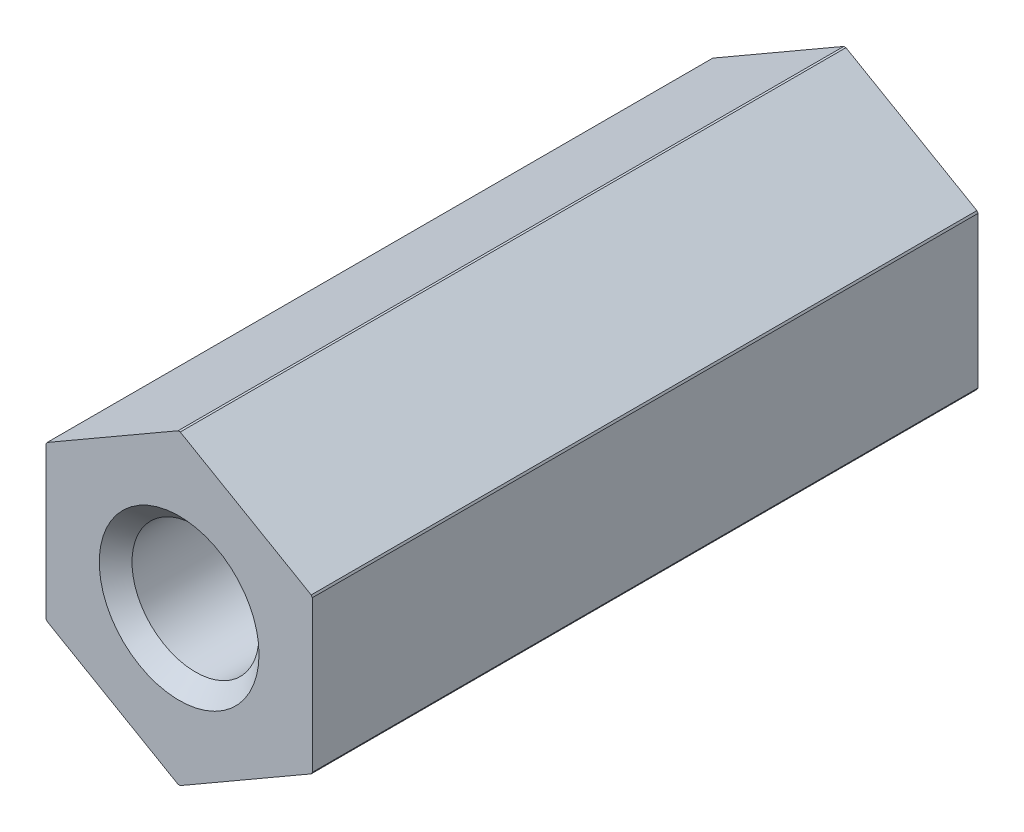
ISO-10303-21;
HEADER;
FILE_DESCRIPTION(('STEP AP214'),'2;1');
FILE_NAME('part.step','',(''),(''),'','','');
FILE_SCHEMA(('AUTOMOTIVE_DESIGN { 1 0 10303 214 1 1 1 1 }'));
ENDSEC;
DATA;
#1=APPLICATION_CONTEXT('core data for automotive mechanical design processes');
#2=APPLICATION_PROTOCOL_DEFINITION('international standard','automotive_design',2000,#1);
#3=PRODUCT_CONTEXT('',#1,'mechanical');
#4=PRODUCT('Part','Part','',(#3));
#5=PRODUCT_RELATED_PRODUCT_CATEGORY('part','',(#4));
#6=PRODUCT_DEFINITION_FORMATION('','',#4);
#7=PRODUCT_DEFINITION_CONTEXT('part definition',#1,'design');
#8=PRODUCT_DEFINITION('design','',#6,#7);
#9=PRODUCT_DEFINITION_SHAPE('','',#8);
#10=(LENGTH_UNIT() NAMED_UNIT(*) SI_UNIT(.MILLI.,.METRE.));
#11=(NAMED_UNIT(*) PLANE_ANGLE_UNIT() SI_UNIT($,.RADIAN.));
#12=(NAMED_UNIT(*) SI_UNIT($,.STERADIAN.) SOLID_ANGLE_UNIT());
#13=UNCERTAINTY_MEASURE_WITH_UNIT(LENGTH_MEASURE(1.E-05),#10,'distance_accuracy_value','');
#14=(GEOMETRIC_REPRESENTATION_CONTEXT(3) GLOBAL_UNCERTAINTY_ASSIGNED_CONTEXT((#13)) GLOBAL_UNIT_ASSIGNED_CONTEXT((#10,
#11,#12)) REPRESENTATION_CONTEXT('',''));
#15=CARTESIAN_POINT('',(0.,0.,0.));
#16=DIRECTION('',(0.,0.,1.));
#17=DIRECTION('',(1.,0.,0.));
#18=AXIS2_PLACEMENT_3D('',#15,#16,#17);
#19=CARTESIAN_POINT('',(0.,0.,0.));
#20=DIRECTION('',(0.,0.,1.));
#21=DIRECTION('',(1.,0.,0.));
#22=AXIS2_PLACEMENT_3D('',#19,#20,#21);
#23=CYLINDRICAL_SURFACE('',#22,5.75);
#24=CARTESIAN_POINT('',(0.,0.,0.));
#25=DIRECTION('',(0.,0.,1.));
#26=DIRECTION('',(1.,0.,0.));
#27=AXIS2_PLACEMENT_3D('',#24,#25,#26);
#28=CIRCLE('',#27,5.75);
#29=CARTESIAN_POINT('',(0.0409605533868234,5.74985410537226,0.));
#30=VERTEX_POINT('',#29);
#31=CARTESIAN_POINT('',(-0.0409605533868229,5.74985410537226,0.));
#32=VERTEX_POINT('',#31);
#33=EDGE_CURVE('E142',#30,#32,#28,.T.);
#34=ORIENTED_EDGE('',*,*,#33,.T.);
#35=DIRECTION('',(0.,0.,1.));
#36=VECTOR('',#35,1.);
#37=CARTESIAN_POINT('',(-0.0409605533868234,5.74985410537226,0.));
#38=LINE('',#37,#36);
#39=CARTESIAN_POINT('',(-0.0409605533868229,5.74985410537226,25.));
#40=VERTEX_POINT('',#39);
#41=EDGE_CURVE('E11',#32,#40,#38,.T.);
#42=ORIENTED_EDGE('',*,*,#41,.T.);
#43=CARTESIAN_POINT('',(0.,0.,25.));
#44=DIRECTION('',(0.,0.,1.));
#45=DIRECTION('',(1.,0.,0.));
#46=AXIS2_PLACEMENT_3D('',#43,#44,#45);
#47=CIRCLE('',#46,5.75);
#48=CARTESIAN_POINT('',(0.0409605533868212,5.74985410537226,25.));
#49=VERTEX_POINT('',#48);
#50=EDGE_CURVE('E164',#49,#40,#47,.T.);
#51=ORIENTED_EDGE('',*,*,#50,.F.);
#52=DIRECTION('',(0.,0.,1.));
#53=VECTOR('',#52,1.);
#54=CARTESIAN_POINT('',(0.0409605533868234,5.74985410537226,0.));
#55=LINE('',#54,#53);
#56=EDGE_CURVE('E130',#49,#30,#55,.F.);
#57=ORIENTED_EDGE('',*,*,#56,.T.);
#58=EDGE_LOOP('',(#34,#42,#51,#57));
#59=FACE_BOUND('',#58,.T.);
#60=ADVANCED_FACE('F30',(#59),#23,.T.);
#61=CARTESIAN_POINT('',(-4.95903944661327,2.91039993247208,25.));
#62=VERTEX_POINT('',#61);
#63=CARTESIAN_POINT('',(-5.,2.83945417290014,25.));
#64=VERTEX_POINT('',#63);
#65=EDGE_CURVE('E169',#62,#64,#47,.T.);
#66=ORIENTED_EDGE('',*,*,#65,.F.);
#67=DIRECTION('',(0.,0.,1.));
#68=VECTOR('',#67,1.);
#69=CARTESIAN_POINT('',(-4.95903944661327,2.91039993247208,0.));
#70=LINE('',#69,#68);
#71=CARTESIAN_POINT('',(-4.95903944661327,2.91039993247208,0.));
#72=VERTEX_POINT('',#71);
#73=EDGE_CURVE('E38',#62,#72,#70,.F.);
#74=ORIENTED_EDGE('',*,*,#73,.T.);
#75=CARTESIAN_POINT('',(-5.,2.83945417290014,0.));
#76=VERTEX_POINT('',#75);
#77=EDGE_CURVE('E154',#72,#76,#28,.T.);
#78=ORIENTED_EDGE('',*,*,#77,.T.);
#79=DIRECTION('',(0.,0.,1.));
#80=VECTOR('',#79,1.);
#81=CARTESIAN_POINT('',(-5.,2.83945417290014,0.));
#82=LINE('',#81,#80);
#83=EDGE_CURVE('E211',#76,#64,#82,.T.);
#84=ORIENTED_EDGE('',*,*,#83,.T.);
#85=EDGE_LOOP('',(#66,#74,#78,#84));
#86=FACE_BOUND('',#85,.T.);
#87=ADVANCED_FACE('F217',(#86),#23,.T.);
#88=CARTESIAN_POINT('',(-5.,-2.83945417290014,25.));
#89=VERTEX_POINT('',#88);
#90=CARTESIAN_POINT('',(-4.95903944661327,-2.91039993247208,25.));
#91=VERTEX_POINT('',#90);
#92=EDGE_CURVE('E175',#89,#91,#47,.T.);
#93=ORIENTED_EDGE('',*,*,#92,.F.);
#94=DIRECTION('',(0.,0.,1.));
#95=VECTOR('',#94,1.);
#96=CARTESIAN_POINT('',(-5.,-2.83945417290014,0.));
#97=LINE('',#96,#95);
#98=CARTESIAN_POINT('',(-5.,-2.83945417290014,0.));
#99=VERTEX_POINT('',#98);
#100=EDGE_CURVE('E203',#89,#99,#97,.F.);
#101=ORIENTED_EDGE('',*,*,#100,.T.);
#102=CARTESIAN_POINT('',(-4.95903944661327,-2.91039993247208,0.));
#103=VERTEX_POINT('',#102);
#104=EDGE_CURVE('E163',#99,#103,#28,.T.);
#105=ORIENTED_EDGE('',*,*,#104,.T.);
#106=DIRECTION('',(0.,0.,1.));
#107=VECTOR('',#106,1.);
#108=CARTESIAN_POINT('',(-4.95903944661327,-2.91039993247208,0.));
#109=LINE('',#108,#107);
#110=EDGE_CURVE('E200',#103,#91,#109,.T.);
#111=ORIENTED_EDGE('',*,*,#110,.T.);
#112=EDGE_LOOP('',(#93,#101,#105,#111));
#113=FACE_BOUND('',#112,.T.);
#114=ADVANCED_FACE('F226',(#113),#23,.T.);
#115=CARTESIAN_POINT('',(-0.0409605533868212,-5.74985410537226,25.));
#116=VERTEX_POINT('',#115);
#117=CARTESIAN_POINT('',(0.0409605533868229,-5.74985410537226,25.));
#118=VERTEX_POINT('',#117);
#119=EDGE_CURVE('E171',#116,#118,#47,.T.);
#120=ORIENTED_EDGE('',*,*,#119,.F.);
#121=DIRECTION('',(0.,0.,1.));
#122=VECTOR('',#121,1.);
#123=CARTESIAN_POINT('',(-0.0409605533868234,-5.74985410537226,0.));
#124=LINE('',#123,#122);
#125=CARTESIAN_POINT('',(-0.0409605533868234,-5.74985410537226,0.));
#126=VERTEX_POINT('',#125);
#127=EDGE_CURVE('E198',#116,#126,#124,.F.);
#128=ORIENTED_EDGE('',*,*,#127,.T.);
#129=CARTESIAN_POINT('',(0.0409605533868229,-5.74985410537226,0.));
#130=VERTEX_POINT('',#129);
#131=EDGE_CURVE('E157',#126,#130,#28,.T.);
#132=ORIENTED_EDGE('',*,*,#131,.T.);
#133=DIRECTION('',(0.,0.,1.));
#134=VECTOR('',#133,1.);
#135=CARTESIAN_POINT('',(0.0409605533868234,-5.74985410537226,0.));
#136=LINE('',#135,#134);
#137=EDGE_CURVE('E197',#130,#118,#136,.T.);
#138=ORIENTED_EDGE('',*,*,#137,.T.);
#139=EDGE_LOOP('',(#120,#128,#132,#138));
#140=FACE_BOUND('',#139,.T.);
#141=ADVANCED_FACE('F196',(#140),#23,.T.);
#142=CARTESIAN_POINT('',(4.95903944661327,-2.91039993247208,25.));
#143=VERTEX_POINT('',#142);
#144=CARTESIAN_POINT('',(5.,-2.83945417290014,25.));
#145=VERTEX_POINT('',#144);
#146=EDGE_CURVE('E165',#143,#145,#47,.T.);
#147=ORIENTED_EDGE('',*,*,#146,.F.);
#148=DIRECTION('',(0.,0.,1.));
#149=VECTOR('',#148,1.);
#150=CARTESIAN_POINT('',(4.95903944661327,-2.91039993247208,0.));
#151=LINE('',#150,#149);
#152=CARTESIAN_POINT('',(4.95903944661327,-2.91039993247208,0.));
#153=VERTEX_POINT('',#152);
#154=EDGE_CURVE('E205',#143,#153,#151,.F.);
#155=ORIENTED_EDGE('',*,*,#154,.T.);
#156=CARTESIAN_POINT('',(5.,-2.83945417290014,0.));
#157=VERTEX_POINT('',#156);
#158=EDGE_CURVE('E150',#153,#157,#28,.T.);
#159=ORIENTED_EDGE('',*,*,#158,.T.);
#160=DIRECTION('',(0.,0.,1.));
#161=VECTOR('',#160,1.);
#162=CARTESIAN_POINT('',(5.,-2.83945417290014,0.));
#163=LINE('',#162,#161);
#164=EDGE_CURVE('E191',#157,#145,#163,.T.);
#165=ORIENTED_EDGE('',*,*,#164,.T.);
#166=EDGE_LOOP('',(#147,#155,#159,#165));
#167=FACE_BOUND('',#166,.T.);
#168=ADVANCED_FACE('F236',(#167),#23,.T.);
#169=CARTESIAN_POINT('',(0.,5.75,25.));
#170=DIRECTION('',(0.,0.,-1.));
#171=DIRECTION('',(-1.,0.,0.));
#172=AXIS2_PLACEMENT_3D('',#169,#170,#171);
#173=PLANE('',#172);
#174=CARTESIAN_POINT('',(0.,0.,25.));
#175=DIRECTION('',(0.,0.,1.));
#176=DIRECTION('',(1.,0.,0.));
#177=AXIS2_PLACEMENT_3D('',#174,#175,#176);
#178=CIRCLE('',#177,3.);
#179=CARTESIAN_POINT('',(3.,0.,25.));
#180=VERTEX_POINT('',#179);
#181=EDGE_CURVE('E241',#180,#180,#178,.T.);
#182=ORIENTED_EDGE('',*,*,#181,.F.);
#183=EDGE_LOOP('',(#182));
#184=FACE_BOUND('',#183,.T.);
#185=ORIENTED_EDGE('',*,*,#50,.T.);
#186=DIRECTION('',(-0.866025403784433,-0.500000000000009,0.));
#187=VECTOR('',#186,1.);
#188=CARTESIAN_POINT('',(0.,5.7735026918963,25.));
#189=LINE('',#188,#187);
#190=EDGE_CURVE('E143',#40,#62,#189,.T.);
#191=ORIENTED_EDGE('',*,*,#190,.T.);
#192=ORIENTED_EDGE('',*,*,#65,.T.);
#193=DIRECTION('',(0.,-1.,0.));
#194=VECTOR('',#193,1.);
#195=CARTESIAN_POINT('',(-5.,2.8867513459481,25.));
#196=LINE('',#195,#194);
#197=EDGE_CURVE('E231',#64,#89,#196,.T.);
#198=ORIENTED_EDGE('',*,*,#197,.T.);
#199=ORIENTED_EDGE('',*,*,#92,.T.);
#200=DIRECTION('',(0.866025403784433,-0.500000000000009,0.));
#201=VECTOR('',#200,1.);
#202=CARTESIAN_POINT('',(-5.,-2.8867513459481,25.));
#203=LINE('',#202,#201);
#204=EDGE_CURVE('E232',#91,#116,#203,.T.);
#205=ORIENTED_EDGE('',*,*,#204,.T.);
#206=ORIENTED_EDGE('',*,*,#119,.T.);
#207=DIRECTION('',(0.866025403784433,0.500000000000009,0.));
#208=VECTOR('',#207,1.);
#209=CARTESIAN_POINT('',(0.,-5.7735026918963,25.));
#210=LINE('',#209,#208);
#211=EDGE_CURVE('E179',#118,#143,#210,.T.);
#212=ORIENTED_EDGE('',*,*,#211,.T.);
#213=ORIENTED_EDGE('',*,*,#146,.T.);
#214=DIRECTION('',(0.,1.,0.));
#215=VECTOR('',#214,1.);
#216=CARTESIAN_POINT('',(5.,-2.8867513459481,25.));
#217=LINE('',#216,#215);
#218=CARTESIAN_POINT('',(5.,2.83945417290014,25.));
#219=VERTEX_POINT('',#218);
#220=EDGE_CURVE('E176',#145,#219,#217,.T.);
#221=ORIENTED_EDGE('',*,*,#220,.T.);
#222=CARTESIAN_POINT('',(4.95903944661327,2.91039993247208,25.));
#223=VERTEX_POINT('',#222);
#224=EDGE_CURVE('E158',#219,#223,#47,.T.);
#225=ORIENTED_EDGE('',*,*,#224,.T.);
#226=DIRECTION('',(-0.866025403784433,0.500000000000009,0.));
#227=VECTOR('',#226,1.);
#228=CARTESIAN_POINT('',(5.,2.8867513459481,25.));
#229=LINE('',#228,#227);
#230=EDGE_CURVE('E124',#223,#49,#229,.T.);
#231=ORIENTED_EDGE('',*,*,#230,.T.);
#232=EDGE_LOOP('',(#185,#191,#192,#198,#199,#205,#206,#212,#213,#221,#225,#231));
#233=FACE_BOUND('',#232,.T.);
#234=ADVANCED_FACE('F32',(#184,#233),#173,.F.);
#235=CARTESIAN_POINT('',(0.,0.,25.));
#236=DIRECTION('',(0.,0.,1.));
#237=DIRECTION('',(1.,0.,0.));
#238=AXIS2_PLACEMENT_3D('',#235,#236,#237);
#239=CONICAL_SURFACE('',#238,3.,0.785398163397448);
#240=CARTESIAN_POINT('',(0.,0.,24.385665));
#241=DIRECTION('',(0.,0.,1.));
#242=DIRECTION('',(1.,0.,0.));
#243=AXIS2_PLACEMENT_3D('',#240,#241,#242);
#244=CIRCLE('',#243,2.385665);
#245=CARTESIAN_POINT('',(2.385665,0.,24.385665));
#246=VERTEX_POINT('',#245);
#247=EDGE_CURVE('E244',#246,#246,#244,.T.);
#248=ORIENTED_EDGE('',*,*,#247,.F.);
#249=EDGE_LOOP('',(#248));
#250=FACE_BOUND('',#249,.T.);
#251=ORIENTED_EDGE('',*,*,#181,.T.);
#252=EDGE_LOOP('',(#251));
#253=FACE_BOUND('',#252,.T.);
#254=ADVANCED_FACE('F255',(#250,#253),#239,.F.);
#255=CARTESIAN_POINT('',(0.,0.,0.));
#256=DIRECTION('',(0.,0.,1.));
#257=DIRECTION('',(1.,0.,0.));
#258=AXIS2_PLACEMENT_3D('',#255,#256,#257);
#259=CYLINDRICAL_SURFACE('',#258,2.385665);
#260=CARTESIAN_POINT('',(0.,0.,1.3174456590112));
#261=DIRECTION('',(0.,0.,1.));
#262=DIRECTION('',(1.,0.,0.));
#263=AXIS2_PLACEMENT_3D('',#260,#261,#262);
#264=CIRCLE('',#263,2.385665);
#265=CARTESIAN_POINT('',(2.385665,0.,1.3174456590112));
#266=VERTEX_POINT('',#265);
#267=EDGE_CURVE('E152',#266,#266,#264,.T.);
#268=ORIENTED_EDGE('',*,*,#267,.F.);
#269=EDGE_LOOP('',(#268));
#270=FACE_BOUND('',#269,.T.);
#271=ORIENTED_EDGE('',*,*,#247,.T.);
#272=EDGE_LOOP('',(#271));
#273=FACE_BOUND('',#272,.T.);
#274=ADVANCED_FACE('F252',(#270,#273),#259,.F.);
#275=CARTESIAN_POINT('',(0.,0.,1.3174456590112));
#276=DIRECTION('',(0.,0.,-1.));
#277=DIRECTION('',(-1.,0.,0.));
#278=AXIS2_PLACEMENT_3D('',#275,#276,#277);
#279=CONICAL_SURFACE('',#278,2.385665,0.436332312998594);
#280=CARTESIAN_POINT('',(0.,0.,0.));
#281=DIRECTION('',(0.,0.,1.));
#282=DIRECTION('',(1.,0.,0.));
#283=AXIS2_PLACEMENT_3D('',#280,#281,#282);
#284=CIRCLE('',#283,3.);
#285=CARTESIAN_POINT('',(3.,0.,0.));
#286=VERTEX_POINT('',#285);
#287=EDGE_CURVE('E148',#286,#286,#284,.T.);
#288=ORIENTED_EDGE('',*,*,#287,.F.);
#289=EDGE_LOOP('',(#288));
#290=FACE_BOUND('',#289,.T.);
#291=ORIENTED_EDGE('',*,*,#267,.T.);
#292=EDGE_LOOP('',(#291));
#293=FACE_BOUND('',#292,.T.);
#294=ADVANCED_FACE('F250',(#290,#293),#279,.F.);
#295=CARTESIAN_POINT('',(0.,3.,0.));
#296=DIRECTION('',(0.,0.,1.));
#297=DIRECTION('',(1.,0.,0.));
#298=AXIS2_PLACEMENT_3D('',#295,#296,#297);
#299=PLANE('',#298);
#300=ORIENTED_EDGE('',*,*,#77,.F.);
#301=DIRECTION('',(-0.866025403784433,-0.500000000000009,0.));
#302=VECTOR('',#301,1.);
#303=CARTESIAN_POINT('',(0.,5.7735026918963,0.));
#304=LINE('',#303,#302);
#305=EDGE_CURVE('E183',#32,#72,#304,.T.);
#306=ORIENTED_EDGE('',*,*,#305,.F.);
#307=ORIENTED_EDGE('',*,*,#33,.F.);
#308=DIRECTION('',(-0.866025403784433,0.500000000000009,0.));
#309=VECTOR('',#308,1.);
#310=CARTESIAN_POINT('',(5.,2.8867513459481,0.));
#311=LINE('',#310,#309);
#312=CARTESIAN_POINT('',(4.95903944661327,2.91039993247208,0.));
#313=VERTEX_POINT('',#312);
#314=EDGE_CURVE('E121',#313,#30,#311,.T.);
#315=ORIENTED_EDGE('',*,*,#314,.F.);
#316=CARTESIAN_POINT('',(5.,2.83945417290014,0.));
#317=VERTEX_POINT('',#316);
#318=EDGE_CURVE('E139',#317,#313,#28,.T.);
#319=ORIENTED_EDGE('',*,*,#318,.F.);
#320=DIRECTION('',(0.,1.,0.));
#321=VECTOR('',#320,1.);
#322=CARTESIAN_POINT('',(5.,-2.8867513459481,0.));
#323=LINE('',#322,#321);
#324=EDGE_CURVE('E144',#157,#317,#323,.T.);
#325=ORIENTED_EDGE('',*,*,#324,.F.);
#326=ORIENTED_EDGE('',*,*,#158,.F.);
#327=DIRECTION('',(0.866025403784433,0.500000000000009,0.));
#328=VECTOR('',#327,1.);
#329=CARTESIAN_POINT('',(0.,-5.7735026918963,0.));
#330=LINE('',#329,#328);
#331=EDGE_CURVE('E45',#130,#153,#330,.T.);
#332=ORIENTED_EDGE('',*,*,#331,.F.);
#333=ORIENTED_EDGE('',*,*,#131,.F.);
#334=DIRECTION('',(0.866025403784433,-0.500000000000009,0.));
#335=VECTOR('',#334,1.);
#336=CARTESIAN_POINT('',(-5.,-2.8867513459481,0.));
#337=LINE('',#336,#335);
#338=EDGE_CURVE('E53',#103,#126,#337,.T.);
#339=ORIENTED_EDGE('',*,*,#338,.F.);
#340=ORIENTED_EDGE('',*,*,#104,.F.);
#341=DIRECTION('',(0.,-1.,0.));
#342=VECTOR('',#341,1.);
#343=CARTESIAN_POINT('',(-5.,2.8867513459481,0.));
#344=LINE('',#343,#342);
#345=EDGE_CURVE('E185',#76,#99,#344,.T.);
#346=ORIENTED_EDGE('',*,*,#345,.F.);
#347=EDGE_LOOP('',(#300,#306,#307,#315,#319,#325,#326,#332,#333,#339,#340,#346));
#348=FACE_BOUND('',#347,.T.);
#349=ORIENTED_EDGE('',*,*,#287,.T.);
#350=EDGE_LOOP('',(#349));
#351=FACE_BOUND('',#350,.T.);
#352=ADVANCED_FACE('F136',(#348,#351),#299,.F.);
#353=ORIENTED_EDGE('',*,*,#224,.F.);
#354=DIRECTION('',(0.,0.,1.));
#355=VECTOR('',#354,1.);
#356=CARTESIAN_POINT('',(5.,2.83945417290014,0.));
#357=LINE('',#356,#355);
#358=EDGE_CURVE('E129',#219,#317,#357,.F.);
#359=ORIENTED_EDGE('',*,*,#358,.T.);
#360=ORIENTED_EDGE('',*,*,#318,.T.);
#361=DIRECTION('',(0.,0.,1.));
#362=VECTOR('',#361,1.);
#363=CARTESIAN_POINT('',(4.95903944661327,2.91039993247208,0.));
#364=LINE('',#363,#362);
#365=EDGE_CURVE('E118',#313,#223,#364,.T.);
#366=ORIENTED_EDGE('',*,*,#365,.T.);
#367=EDGE_LOOP('',(#353,#359,#360,#366));
#368=FACE_BOUND('',#367,.T.);
#369=ADVANCED_FACE('F147',(#368),#23,.T.);
#370=CARTESIAN_POINT('',(5.,2.8867513459481,25.));
#371=DIRECTION('',(-0.500000000000009,-0.866025403784433,0.));
#372=DIRECTION('',(0.866025403784433,-0.500000000000009,0.));
#373=AXIS2_PLACEMENT_3D('',#370,#371,#372);
#374=PLANE('',#373);
#375=ORIENTED_EDGE('',*,*,#314,.T.);
#376=ORIENTED_EDGE('',*,*,#56,.F.);
#377=ORIENTED_EDGE('',*,*,#230,.F.);
#378=ORIENTED_EDGE('',*,*,#365,.F.);
#379=EDGE_LOOP('',(#375,#376,#377,#378));
#380=FACE_BOUND('',#379,.T.);
#381=ADVANCED_FACE('F120',(#380),#374,.F.);
#382=CARTESIAN_POINT('',(5.,-2.8867513459481,25.));
#383=DIRECTION('',(-1.,0.,0.));
#384=DIRECTION('',(0.,0.,1.));
#385=AXIS2_PLACEMENT_3D('',#382,#383,#384);
#386=PLANE('',#385);
#387=ORIENTED_EDGE('',*,*,#324,.T.);
#388=ORIENTED_EDGE('',*,*,#358,.F.);
#389=ORIENTED_EDGE('',*,*,#220,.F.);
#390=ORIENTED_EDGE('',*,*,#164,.F.);
#391=EDGE_LOOP('',(#387,#388,#389,#390));
#392=FACE_BOUND('',#391,.T.);
#393=ADVANCED_FACE('F190',(#392),#386,.F.);
#394=CARTESIAN_POINT('',(0.,-5.7735026918963,25.));
#395=DIRECTION('',(-0.500000000000009,0.866025403784433,0.));
#396=DIRECTION('',(-0.866025403784433,-0.500000000000009,0.));
#397=AXIS2_PLACEMENT_3D('',#394,#395,#396);
#398=PLANE('',#397);
#399=ORIENTED_EDGE('',*,*,#331,.T.);
#400=ORIENTED_EDGE('',*,*,#154,.F.);
#401=ORIENTED_EDGE('',*,*,#211,.F.);
#402=ORIENTED_EDGE('',*,*,#137,.F.);
#403=EDGE_LOOP('',(#399,#400,#401,#402));
#404=FACE_BOUND('',#403,.T.);
#405=ADVANCED_FACE('F353',(#404),#398,.F.);
#406=CARTESIAN_POINT('',(-5.,-2.8867513459481,25.));
#407=DIRECTION('',(0.500000000000009,0.866025403784433,0.));
#408=DIRECTION('',(-0.866025403784433,0.500000000000009,0.));
#409=AXIS2_PLACEMENT_3D('',#406,#407,#408);
#410=PLANE('',#409);
#411=ORIENTED_EDGE('',*,*,#338,.T.);
#412=ORIENTED_EDGE('',*,*,#127,.F.);
#413=ORIENTED_EDGE('',*,*,#204,.F.);
#414=ORIENTED_EDGE('',*,*,#110,.F.);
#415=EDGE_LOOP('',(#411,#412,#413,#414));
#416=FACE_BOUND('',#415,.T.);
#417=ADVANCED_FACE('F361',(#416),#410,.F.);
#418=CARTESIAN_POINT('',(-5.,2.8867513459481,25.));
#419=DIRECTION('',(1.,0.,0.));
#420=DIRECTION('',(0.,0.,-1.));
#421=AXIS2_PLACEMENT_3D('',#418,#419,#420);
#422=PLANE('',#421);
#423=ORIENTED_EDGE('',*,*,#345,.T.);
#424=ORIENTED_EDGE('',*,*,#100,.F.);
#425=ORIENTED_EDGE('',*,*,#197,.F.);
#426=ORIENTED_EDGE('',*,*,#83,.F.);
#427=EDGE_LOOP('',(#423,#424,#425,#426));
#428=FACE_BOUND('',#427,.T.);
#429=ADVANCED_FACE('F230',(#428),#422,.F.);
#430=CARTESIAN_POINT('',(0.,5.7735026918963,25.));
#431=DIRECTION('',(0.500000000000009,-0.866025403784433,0.));
#432=DIRECTION('',(0.866025403784433,0.500000000000009,0.));
#433=AXIS2_PLACEMENT_3D('',#430,#431,#432);
#434=PLANE('',#433);
#435=ORIENTED_EDGE('',*,*,#305,.T.);
#436=ORIENTED_EDGE('',*,*,#73,.F.);
#437=ORIENTED_EDGE('',*,*,#190,.F.);
#438=ORIENTED_EDGE('',*,*,#41,.F.);
#439=EDGE_LOOP('',(#435,#436,#437,#438));
#440=FACE_BOUND('',#439,.T.);
#441=ADVANCED_FACE('F376',(#440),#434,.F.);
#442=CLOSED_SHELL('',(#60,#87,#114,#141,#168,#234,#254,#274,#294,#352,#369,#381,#393,#405,#417,
#429,#441));
#443=MANIFOLD_SOLID_BREP('B2',#442);
#444=ADVANCED_BREP_SHAPE_REPRESENTATION('',(#18,#443),#14);
#445=SHAPE_DEFINITION_REPRESENTATION(#9,#444);
ENDSEC;
END-ISO-10303-21;
